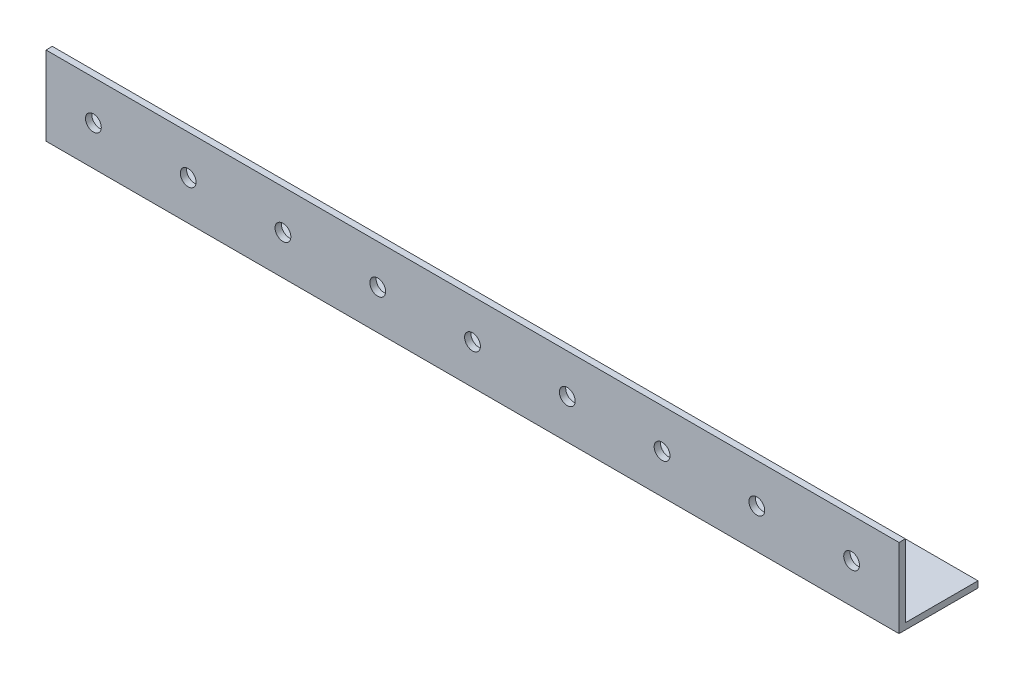
ISO-10303-21;
HEADER;
FILE_DESCRIPTION(('STEP AP214'),'2;1');
FILE_NAME('part.step','',(''),(''),'','','');
FILE_SCHEMA(('AUTOMOTIVE_DESIGN { 1 0 10303 214 1 1 1 1 }'));
ENDSEC;
DATA;
#1=APPLICATION_CONTEXT('core data for automotive mechanical design processes');
#2=APPLICATION_PROTOCOL_DEFINITION('international standard','automotive_design',2000,#1);
#3=PRODUCT_CONTEXT('',#1,'mechanical');
#4=PRODUCT('Part','Part','',(#3));
#5=PRODUCT_RELATED_PRODUCT_CATEGORY('part','',(#4));
#6=PRODUCT_DEFINITION_FORMATION('','',#4);
#7=PRODUCT_DEFINITION_CONTEXT('part definition',#1,'design');
#8=PRODUCT_DEFINITION('design','',#6,#7);
#9=PRODUCT_DEFINITION_SHAPE('','',#8);
#10=(LENGTH_UNIT() NAMED_UNIT(*) SI_UNIT(.MILLI.,.METRE.));
#11=(NAMED_UNIT(*) PLANE_ANGLE_UNIT() SI_UNIT($,.RADIAN.));
#12=(NAMED_UNIT(*) SI_UNIT($,.STERADIAN.) SOLID_ANGLE_UNIT());
#13=UNCERTAINTY_MEASURE_WITH_UNIT(LENGTH_MEASURE(1.E-05),#10,'distance_accuracy_value','');
#14=(GEOMETRIC_REPRESENTATION_CONTEXT(3) GLOBAL_UNCERTAINTY_ASSIGNED_CONTEXT((#13)) GLOBAL_UNIT_ASSIGNED_CONTEXT((#10,
#11,#12)) REPRESENTATION_CONTEXT('',''));
#15=CARTESIAN_POINT('',(0.,0.,0.));
#16=DIRECTION('',(0.,0.,1.));
#17=DIRECTION('',(1.,0.,0.));
#18=AXIS2_PLACEMENT_3D('',#15,#16,#17);
#19=CARTESIAN_POINT('',(539.999999999999,0.,0.));
#20=DIRECTION('',(0.,1.,0.));
#21=DIRECTION('',(0.,0.,1.));
#22=AXIS2_PLACEMENT_3D('',#19,#20,#21);
#23=PLANE('',#22);
#24=CARTESIAN_POINT('',(30.,0.,-25.));
#25=DIRECTION('',(0.,-1.,0.));
#26=DIRECTION('',(0.,0.,-1.));
#27=AXIS2_PLACEMENT_3D('',#24,#25,#26);
#28=CIRCLE('',#27,5.);
#29=CARTESIAN_POINT('',(30.,0.,-30.));
#30=VERTEX_POINT('',#29);
#31=EDGE_CURVE('E141',#30,#30,#28,.T.);
#32=ORIENTED_EDGE('',*,*,#31,.F.);
#33=EDGE_LOOP('',(#32));
#34=FACE_BOUND('',#33,.T.);
#35=CARTESIAN_POINT('',(90.,0.,-25.));
#36=DIRECTION('',(0.,-1.,0.));
#37=DIRECTION('',(0.,0.,-1.));
#38=AXIS2_PLACEMENT_3D('',#35,#36,#37);
#39=CIRCLE('',#38,5.);
#40=CARTESIAN_POINT('',(90.,0.,-30.));
#41=VERTEX_POINT('',#40);
#42=EDGE_CURVE('E257',#41,#41,#39,.T.);
#43=ORIENTED_EDGE('',*,*,#42,.F.);
#44=EDGE_LOOP('',(#43));
#45=FACE_BOUND('',#44,.T.);
#46=CARTESIAN_POINT('',(150.,0.,-25.));
#47=DIRECTION('',(0.,-1.,0.));
#48=DIRECTION('',(0.,0.,-1.));
#49=AXIS2_PLACEMENT_3D('',#46,#47,#48);
#50=CIRCLE('',#49,5.00000000000002);
#51=CARTESIAN_POINT('',(150.,0.,-30.));
#52=VERTEX_POINT('',#51);
#53=EDGE_CURVE('E261',#52,#52,#50,.T.);
#54=ORIENTED_EDGE('',*,*,#53,.F.);
#55=EDGE_LOOP('',(#54));
#56=FACE_BOUND('',#55,.T.);
#57=CARTESIAN_POINT('',(210.,0.,-25.));
#58=DIRECTION('',(0.,-1.,0.));
#59=DIRECTION('',(0.,0.,-1.));
#60=AXIS2_PLACEMENT_3D('',#57,#58,#59);
#61=CIRCLE('',#60,5.00000000000002);
#62=CARTESIAN_POINT('',(210.,0.,-30.));
#63=VERTEX_POINT('',#62);
#64=EDGE_CURVE('E265',#63,#63,#61,.T.);
#65=ORIENTED_EDGE('',*,*,#64,.F.);
#66=EDGE_LOOP('',(#65));
#67=FACE_BOUND('',#66,.T.);
#68=CARTESIAN_POINT('',(270.,0.,-25.));
#69=DIRECTION('',(0.,-1.,0.));
#70=DIRECTION('',(0.,0.,-1.));
#71=AXIS2_PLACEMENT_3D('',#68,#69,#70);
#72=CIRCLE('',#71,4.99999999999999);
#73=CARTESIAN_POINT('',(270.,0.,-30.));
#74=VERTEX_POINT('',#73);
#75=EDGE_CURVE('E269',#74,#74,#72,.T.);
#76=ORIENTED_EDGE('',*,*,#75,.F.);
#77=EDGE_LOOP('',(#76));
#78=FACE_BOUND('',#77,.T.);
#79=CARTESIAN_POINT('',(330.,0.,-25.));
#80=DIRECTION('',(0.,-1.,0.));
#81=DIRECTION('',(0.,0.,-1.));
#82=AXIS2_PLACEMENT_3D('',#79,#80,#81);
#83=CIRCLE('',#82,5.00000000000004);
#84=CARTESIAN_POINT('',(330.,0.,-30.));
#85=VERTEX_POINT('',#84);
#86=EDGE_CURVE('E273',#85,#85,#83,.T.);
#87=ORIENTED_EDGE('',*,*,#86,.F.);
#88=EDGE_LOOP('',(#87));
#89=FACE_BOUND('',#88,.T.);
#90=CARTESIAN_POINT('',(390.,0.,-25.));
#91=DIRECTION('',(0.,-1.,0.));
#92=DIRECTION('',(0.,0.,-1.));
#93=AXIS2_PLACEMENT_3D('',#90,#91,#92);
#94=CIRCLE('',#93,4.99999999999999);
#95=CARTESIAN_POINT('',(390.,0.,-30.));
#96=VERTEX_POINT('',#95);
#97=EDGE_CURVE('E277',#96,#96,#94,.T.);
#98=ORIENTED_EDGE('',*,*,#97,.F.);
#99=EDGE_LOOP('',(#98));
#100=FACE_BOUND('',#99,.T.);
#101=CARTESIAN_POINT('',(450.,0.,-25.));
#102=DIRECTION('',(0.,-1.,0.));
#103=DIRECTION('',(0.,0.,-1.));
#104=AXIS2_PLACEMENT_3D('',#101,#102,#103);
#105=CIRCLE('',#104,5.00000000000004);
#106=CARTESIAN_POINT('',(450.,0.,-30.));
#107=VERTEX_POINT('',#106);
#108=EDGE_CURVE('E281',#107,#107,#105,.T.);
#109=ORIENTED_EDGE('',*,*,#108,.F.);
#110=EDGE_LOOP('',(#109));
#111=FACE_BOUND('',#110,.T.);
#112=CARTESIAN_POINT('',(510.,0.,-25.));
#113=DIRECTION('',(0.,-1.,0.));
#114=DIRECTION('',(0.,0.,-1.));
#115=AXIS2_PLACEMENT_3D('',#112,#113,#114);
#116=CIRCLE('',#115,4.99999999999994);
#117=CARTESIAN_POINT('',(510.,0.,-29.9999999999999));
#118=VERTEX_POINT('',#117);
#119=EDGE_CURVE('E284',#118,#118,#116,.T.);
#120=ORIENTED_EDGE('',*,*,#119,.F.);
#121=EDGE_LOOP('',(#120));
#122=FACE_BOUND('',#121,.T.);
#123=DIRECTION('',(0.,0.,-1.));
#124=VECTOR('',#123,1.);
#125=CARTESIAN_POINT('',(0.,0.,0.));
#126=LINE('',#125,#124);
#127=CARTESIAN_POINT('',(0.,0.,0.));
#128=VERTEX_POINT('',#127);
#129=CARTESIAN_POINT('',(0.,0.,-50.));
#130=VERTEX_POINT('',#129);
#131=EDGE_CURVE('E119',#128,#130,#126,.T.);
#132=ORIENTED_EDGE('',*,*,#131,.T.);
#133=DIRECTION('',(-1.,0.,0.));
#134=VECTOR('',#133,1.);
#135=CARTESIAN_POINT('',(539.999999999999,0.,-50.));
#136=LINE('',#135,#134);
#137=CARTESIAN_POINT('',(539.999999999999,0.,-50.));
#138=VERTEX_POINT('',#137);
#139=EDGE_CURVE('E11',#138,#130,#136,.T.);
#140=ORIENTED_EDGE('',*,*,#139,.F.);
#141=DIRECTION('',(0.,0.,-1.));
#142=VECTOR('',#141,1.);
#143=CARTESIAN_POINT('',(539.999999999999,0.,0.));
#144=LINE('',#143,#142);
#145=CARTESIAN_POINT('',(539.999999999999,0.,0.));
#146=VERTEX_POINT('',#145);
#147=EDGE_CURVE('E84',#146,#138,#144,.T.);
#148=ORIENTED_EDGE('',*,*,#147,.F.);
#149=DIRECTION('',(-1.,0.,0.));
#150=VECTOR('',#149,1.);
#151=CARTESIAN_POINT('',(539.999999999999,0.,0.));
#152=LINE('',#151,#150);
#153=EDGE_CURVE('E115',#146,#128,#152,.T.);
#154=ORIENTED_EDGE('',*,*,#153,.T.);
#155=EDGE_LOOP('',(#132,#140,#148,#154));
#156=FACE_BOUND('',#155,.T.);
#157=ADVANCED_FACE('F36',(#34,#45,#56,#67,#78,#89,#100,#111,#122,#156),#23,.F.);
#158=CARTESIAN_POINT('',(539.999999999999,4.,-50.));
#159=DIRECTION('',(0.,0.,-1.));
#160=DIRECTION('',(-1.,0.,0.));
#161=AXIS2_PLACEMENT_3D('',#158,#159,#160);
#162=PLANE('',#161);
#163=DIRECTION('',(0.,-1.,0.));
#164=VECTOR('',#163,1.);
#165=CARTESIAN_POINT('',(0.,4.,-50.));
#166=LINE('',#165,#164);
#167=CARTESIAN_POINT('',(0.,4.,-50.));
#168=VERTEX_POINT('',#167);
#169=EDGE_CURVE('E122',#168,#130,#166,.T.);
#170=ORIENTED_EDGE('',*,*,#169,.F.);
#171=DIRECTION('',(-1.,0.,0.));
#172=VECTOR('',#171,1.);
#173=CARTESIAN_POINT('',(539.999999999999,4.,-50.));
#174=LINE('',#173,#172);
#175=CARTESIAN_POINT('',(539.999999999999,4.,-50.));
#176=VERTEX_POINT('',#175);
#177=EDGE_CURVE('E45',#176,#168,#174,.T.);
#178=ORIENTED_EDGE('',*,*,#177,.F.);
#179=DIRECTION('',(0.,-1.,0.));
#180=VECTOR('',#179,1.);
#181=CARTESIAN_POINT('',(539.999999999999,4.,-50.));
#182=LINE('',#181,#180);
#183=EDGE_CURVE('E221',#176,#138,#182,.T.);
#184=ORIENTED_EDGE('',*,*,#183,.T.);
#185=ORIENTED_EDGE('',*,*,#139,.T.);
#186=EDGE_LOOP('',(#170,#178,#184,#185));
#187=FACE_BOUND('',#186,.T.);
#188=ADVANCED_FACE('F245',(#187),#162,.T.);
#189=CARTESIAN_POINT('',(539.999999999999,4.,0.));
#190=DIRECTION('',(0.,1.,0.));
#191=DIRECTION('',(0.,0.,1.));
#192=AXIS2_PLACEMENT_3D('',#189,#190,#191);
#193=PLANE('',#192);
#194=CARTESIAN_POINT('',(30.,4.,-25.));
#195=DIRECTION('',(0.,1.,0.));
#196=DIRECTION('',(0.,0.,1.));
#197=AXIS2_PLACEMENT_3D('',#194,#195,#196);
#198=CIRCLE('',#197,5.);
#199=CARTESIAN_POINT('',(30.,4.,-20.));
#200=VERTEX_POINT('',#199);
#201=EDGE_CURVE('E39',#200,#200,#198,.T.);
#202=ORIENTED_EDGE('',*,*,#201,.F.);
#203=EDGE_LOOP('',(#202));
#204=FACE_BOUND('',#203,.T.);
#205=CARTESIAN_POINT('',(90.,4.,-25.));
#206=DIRECTION('',(0.,1.,0.));
#207=DIRECTION('',(0.,0.,1.));
#208=AXIS2_PLACEMENT_3D('',#205,#206,#207);
#209=CIRCLE('',#208,5.);
#210=CARTESIAN_POINT('',(90.,4.,-20.));
#211=VERTEX_POINT('',#210);
#212=EDGE_CURVE('E158',#211,#211,#209,.T.);
#213=ORIENTED_EDGE('',*,*,#212,.F.);
#214=EDGE_LOOP('',(#213));
#215=FACE_BOUND('',#214,.T.);
#216=CARTESIAN_POINT('',(150.,4.,-25.));
#217=DIRECTION('',(0.,1.,0.));
#218=DIRECTION('',(0.,0.,1.));
#219=AXIS2_PLACEMENT_3D('',#216,#217,#218);
#220=CIRCLE('',#219,5.00000000000002);
#221=CARTESIAN_POINT('',(150.,4.,-20.));
#222=VERTEX_POINT('',#221);
#223=EDGE_CURVE('E156',#222,#222,#220,.T.);
#224=ORIENTED_EDGE('',*,*,#223,.F.);
#225=EDGE_LOOP('',(#224));
#226=FACE_BOUND('',#225,.T.);
#227=CARTESIAN_POINT('',(210.,4.,-25.));
#228=DIRECTION('',(0.,1.,0.));
#229=DIRECTION('',(0.,0.,1.));
#230=AXIS2_PLACEMENT_3D('',#227,#228,#229);
#231=CIRCLE('',#230,5.00000000000002);
#232=CARTESIAN_POINT('',(210.,4.,-20.));
#233=VERTEX_POINT('',#232);
#234=EDGE_CURVE('E153',#233,#233,#231,.T.);
#235=ORIENTED_EDGE('',*,*,#234,.F.);
#236=EDGE_LOOP('',(#235));
#237=FACE_BOUND('',#236,.T.);
#238=CARTESIAN_POINT('',(270.,4.,-25.));
#239=DIRECTION('',(0.,1.,0.));
#240=DIRECTION('',(0.,0.,1.));
#241=AXIS2_PLACEMENT_3D('',#238,#239,#240);
#242=CIRCLE('',#241,4.99999999999999);
#243=CARTESIAN_POINT('',(270.,4.,-20.));
#244=VERTEX_POINT('',#243);
#245=EDGE_CURVE('E150',#244,#244,#242,.T.);
#246=ORIENTED_EDGE('',*,*,#245,.F.);
#247=EDGE_LOOP('',(#246));
#248=FACE_BOUND('',#247,.T.);
#249=CARTESIAN_POINT('',(330.,4.,-25.));
#250=DIRECTION('',(0.,1.,0.));
#251=DIRECTION('',(0.,0.,1.));
#252=AXIS2_PLACEMENT_3D('',#249,#250,#251);
#253=CIRCLE('',#252,5.00000000000004);
#254=CARTESIAN_POINT('',(330.,4.,-20.));
#255=VERTEX_POINT('',#254);
#256=EDGE_CURVE('E147',#255,#255,#253,.T.);
#257=ORIENTED_EDGE('',*,*,#256,.F.);
#258=EDGE_LOOP('',(#257));
#259=FACE_BOUND('',#258,.T.);
#260=CARTESIAN_POINT('',(390.,4.,-25.));
#261=DIRECTION('',(0.,1.,0.));
#262=DIRECTION('',(0.,0.,1.));
#263=AXIS2_PLACEMENT_3D('',#260,#261,#262);
#264=CIRCLE('',#263,4.99999999999999);
#265=CARTESIAN_POINT('',(390.,4.,-20.));
#266=VERTEX_POINT('',#265);
#267=EDGE_CURVE('E144',#266,#266,#264,.T.);
#268=ORIENTED_EDGE('',*,*,#267,.F.);
#269=EDGE_LOOP('',(#268));
#270=FACE_BOUND('',#269,.T.);
#271=CARTESIAN_POINT('',(450.,4.,-25.));
#272=DIRECTION('',(0.,1.,0.));
#273=DIRECTION('',(0.,0.,1.));
#274=AXIS2_PLACEMENT_3D('',#271,#272,#273);
#275=CIRCLE('',#274,5.00000000000004);
#276=CARTESIAN_POINT('',(450.,4.,-20.));
#277=VERTEX_POINT('',#276);
#278=EDGE_CURVE('E140',#277,#277,#275,.T.);
#279=ORIENTED_EDGE('',*,*,#278,.F.);
#280=EDGE_LOOP('',(#279));
#281=FACE_BOUND('',#280,.T.);
#282=CARTESIAN_POINT('',(510.,4.,-25.));
#283=DIRECTION('',(0.,1.,0.));
#284=DIRECTION('',(0.,0.,1.));
#285=AXIS2_PLACEMENT_3D('',#282,#283,#284);
#286=CIRCLE('',#285,4.99999999999994);
#287=CARTESIAN_POINT('',(510.,4.,-20.0000000000001));
#288=VERTEX_POINT('',#287);
#289=EDGE_CURVE('E137',#288,#288,#286,.T.);
#290=ORIENTED_EDGE('',*,*,#289,.F.);
#291=EDGE_LOOP('',(#290));
#292=FACE_BOUND('',#291,.T.);
#293=DIRECTION('',(0.,0.,-1.));
#294=VECTOR('',#293,1.);
#295=CARTESIAN_POINT('',(0.,4.,0.));
#296=LINE('',#295,#294);
#297=CARTESIAN_POINT('',(0.,4.,-4.));
#298=VERTEX_POINT('',#297);
#299=EDGE_CURVE('E126',#298,#168,#296,.T.);
#300=ORIENTED_EDGE('',*,*,#299,.F.);
#301=DIRECTION('',(-1.,0.,0.));
#302=VECTOR('',#301,1.);
#303=CARTESIAN_POINT('',(539.999999999999,4.,-4.));
#304=LINE('',#303,#302);
#305=CARTESIAN_POINT('',(539.999999999999,4.,-4.));
#306=VERTEX_POINT('',#305);
#307=EDGE_CURVE('E105',#306,#298,#304,.T.);
#308=ORIENTED_EDGE('',*,*,#307,.F.);
#309=DIRECTION('',(0.,0.,-1.));
#310=VECTOR('',#309,1.);
#311=CARTESIAN_POINT('',(539.999999999999,4.,0.));
#312=LINE('',#311,#310);
#313=EDGE_CURVE('E111',#306,#176,#312,.T.);
#314=ORIENTED_EDGE('',*,*,#313,.T.);
#315=ORIENTED_EDGE('',*,*,#177,.T.);
#316=EDGE_LOOP('',(#300,#308,#314,#315));
#317=FACE_BOUND('',#316,.T.);
#318=ADVANCED_FACE('F225',(#204,#215,#226,#237,#248,#259,#270,#281,#292,#317),#193,.T.);
#319=CARTESIAN_POINT('',(539.999999999999,0.,-4.));
#320=DIRECTION('',(0.,0.,-1.));
#321=DIRECTION('',(-1.,0.,0.));
#322=AXIS2_PLACEMENT_3D('',#319,#320,#321);
#323=PLANE('',#322);
#324=CARTESIAN_POINT('',(29.9999999999998,25.,-4.));
#325=DIRECTION('',(0.,0.,-1.));
#326=DIRECTION('',(-1.,0.,0.));
#327=AXIS2_PLACEMENT_3D('',#324,#325,#326);
#328=CIRCLE('',#327,4.99999999999998);
#329=CARTESIAN_POINT('',(24.9999999999998,25.,-4.));
#330=VERTEX_POINT('',#329);
#331=EDGE_CURVE('E123',#330,#330,#328,.T.);
#332=ORIENTED_EDGE('',*,*,#331,.F.);
#333=EDGE_LOOP('',(#332));
#334=FACE_BOUND('',#333,.T.);
#335=CARTESIAN_POINT('',(389.999999999999,25.,-4.));
#336=DIRECTION('',(0.,0.,-1.));
#337=DIRECTION('',(-1.,0.,0.));
#338=AXIS2_PLACEMENT_3D('',#335,#336,#337);
#339=CIRCLE('',#338,4.99999999999999);
#340=CARTESIAN_POINT('',(384.999999999999,25.,-4.));
#341=VERTEX_POINT('',#340);
#342=EDGE_CURVE('E215',#341,#341,#339,.T.);
#343=ORIENTED_EDGE('',*,*,#342,.F.);
#344=EDGE_LOOP('',(#343));
#345=FACE_BOUND('',#344,.T.);
#346=CARTESIAN_POINT('',(449.999999999999,25.,-4.));
#347=DIRECTION('',(0.,0.,-1.));
#348=DIRECTION('',(-1.,0.,0.));
#349=AXIS2_PLACEMENT_3D('',#346,#347,#348);
#350=CIRCLE('',#349,4.99999999999999);
#351=CARTESIAN_POINT('',(444.999999999999,25.,-4.));
#352=VERTEX_POINT('',#351);
#353=EDGE_CURVE('E212',#352,#352,#350,.T.);
#354=ORIENTED_EDGE('',*,*,#353,.F.);
#355=EDGE_LOOP('',(#354));
#356=FACE_BOUND('',#355,.T.);
#357=CARTESIAN_POINT('',(509.999999999999,25.,-4.));
#358=DIRECTION('',(0.,0.,-1.));
#359=DIRECTION('',(-1.,0.,0.));
#360=AXIS2_PLACEMENT_3D('',#357,#358,#359);
#361=CIRCLE('',#360,4.99999999999994);
#362=CARTESIAN_POINT('',(504.999999999999,25.,-4.));
#363=VERTEX_POINT('',#362);
#364=EDGE_CURVE('E209',#363,#363,#361,.T.);
#365=ORIENTED_EDGE('',*,*,#364,.F.);
#366=EDGE_LOOP('',(#365));
#367=FACE_BOUND('',#366,.T.);
#368=CARTESIAN_POINT('',(269.999999999999,25.,-4.));
#369=DIRECTION('',(0.,0.,-1.));
#370=DIRECTION('',(-1.,0.,0.));
#371=AXIS2_PLACEMENT_3D('',#368,#369,#370);
#372=CIRCLE('',#371,4.99999999999999);
#373=CARTESIAN_POINT('',(264.999999999999,25.,-4.));
#374=VERTEX_POINT('',#373);
#375=EDGE_CURVE('E206',#374,#374,#372,.T.);
#376=ORIENTED_EDGE('',*,*,#375,.F.);
#377=EDGE_LOOP('',(#376));
#378=FACE_BOUND('',#377,.T.);
#379=CARTESIAN_POINT('',(329.999999999999,25.,-4.));
#380=DIRECTION('',(0.,0.,-1.));
#381=DIRECTION('',(-1.,0.,0.));
#382=AXIS2_PLACEMENT_3D('',#379,#380,#381);
#383=CIRCLE('',#382,4.99999999999999);
#384=CARTESIAN_POINT('',(324.999999999999,25.,-4.));
#385=VERTEX_POINT('',#384);
#386=EDGE_CURVE('E203',#385,#385,#383,.T.);
#387=ORIENTED_EDGE('',*,*,#386,.F.);
#388=EDGE_LOOP('',(#387));
#389=FACE_BOUND('',#388,.T.);
#390=CARTESIAN_POINT('',(209.999999999999,25.,-4.));
#391=DIRECTION('',(0.,0.,-1.));
#392=DIRECTION('',(-1.,0.,0.));
#393=AXIS2_PLACEMENT_3D('',#390,#391,#392);
#394=CIRCLE('',#393,5.00000000000008);
#395=CARTESIAN_POINT('',(204.999999999999,25.,-4.));
#396=VERTEX_POINT('',#395);
#397=EDGE_CURVE('E200',#396,#396,#394,.T.);
#398=ORIENTED_EDGE('',*,*,#397,.F.);
#399=EDGE_LOOP('',(#398));
#400=FACE_BOUND('',#399,.T.);
#401=CARTESIAN_POINT('',(150.,25.,-4.));
#402=DIRECTION('',(0.,0.,-1.));
#403=DIRECTION('',(-1.,0.,0.));
#404=AXIS2_PLACEMENT_3D('',#401,#402,#403);
#405=CIRCLE('',#404,5.00000000000005);
#406=CARTESIAN_POINT('',(145.,25.,-4.));
#407=VERTEX_POINT('',#406);
#408=EDGE_CURVE('E197',#407,#407,#405,.T.);
#409=ORIENTED_EDGE('',*,*,#408,.F.);
#410=EDGE_LOOP('',(#409));
#411=FACE_BOUND('',#410,.T.);
#412=CARTESIAN_POINT('',(89.9999999999997,25.,-4.));
#413=DIRECTION('',(0.,0.,-1.));
#414=DIRECTION('',(-1.,0.,0.));
#415=AXIS2_PLACEMENT_3D('',#412,#413,#414);
#416=CIRCLE('',#415,4.99999999999999);
#417=CARTESIAN_POINT('',(84.9999999999997,25.,-4.));
#418=VERTEX_POINT('',#417);
#419=EDGE_CURVE('E194',#418,#418,#416,.T.);
#420=ORIENTED_EDGE('',*,*,#419,.F.);
#421=EDGE_LOOP('',(#420));
#422=FACE_BOUND('',#421,.T.);
#423=DIRECTION('',(0.,1.,0.));
#424=VECTOR('',#423,1.);
#425=CARTESIAN_POINT('',(0.,0.,-4.));
#426=LINE('',#425,#424);
#427=CARTESIAN_POINT('',(0.,50.,-4.));
#428=VERTEX_POINT('',#427);
#429=EDGE_CURVE('E100',#428,#298,#426,.F.);
#430=ORIENTED_EDGE('',*,*,#429,.F.);
#431=DIRECTION('',(-1.,0.,0.));
#432=VECTOR('',#431,1.);
#433=CARTESIAN_POINT('',(539.999999999999,50.,-4.));
#434=LINE('',#433,#432);
#435=CARTESIAN_POINT('',(539.999999999999,50.,-4.));
#436=VERTEX_POINT('',#435);
#437=EDGE_CURVE('E95',#436,#428,#434,.T.);
#438=ORIENTED_EDGE('',*,*,#437,.F.);
#439=DIRECTION('',(0.,1.,0.));
#440=VECTOR('',#439,1.);
#441=CARTESIAN_POINT('',(539.999999999999,0.,-4.));
#442=LINE('',#441,#440);
#443=EDGE_CURVE('E98',#436,#306,#442,.F.);
#444=ORIENTED_EDGE('',*,*,#443,.T.);
#445=ORIENTED_EDGE('',*,*,#307,.T.);
#446=EDGE_LOOP('',(#430,#438,#444,#445));
#447=FACE_BOUND('',#446,.T.);
#448=ADVANCED_FACE('F97',(#334,#345,#356,#367,#378,#389,#400,#411,#422,#447),#323,.T.);
#449=CARTESIAN_POINT('',(539.999999999999,50.,0.));
#450=DIRECTION('',(0.,1.,0.));
#451=DIRECTION('',(0.,0.,1.));
#452=AXIS2_PLACEMENT_3D('',#449,#450,#451);
#453=PLANE('',#452);
#454=DIRECTION('',(0.,0.,-1.));
#455=VECTOR('',#454,1.);
#456=CARTESIAN_POINT('',(0.,50.,0.));
#457=LINE('',#456,#455);
#458=CARTESIAN_POINT('',(0.,50.,0.));
#459=VERTEX_POINT('',#458);
#460=EDGE_CURVE('E130',#459,#428,#457,.T.);
#461=ORIENTED_EDGE('',*,*,#460,.F.);
#462=DIRECTION('',(-1.,0.,0.));
#463=VECTOR('',#462,1.);
#464=CARTESIAN_POINT('',(539.999999999999,50.,0.));
#465=LINE('',#464,#463);
#466=CARTESIAN_POINT('',(539.999999999999,50.,0.));
#467=VERTEX_POINT('',#466);
#468=EDGE_CURVE('E75',#467,#459,#465,.T.);
#469=ORIENTED_EDGE('',*,*,#468,.F.);
#470=DIRECTION('',(0.,0.,-1.));
#471=VECTOR('',#470,1.);
#472=CARTESIAN_POINT('',(539.999999999999,50.,0.));
#473=LINE('',#472,#471);
#474=EDGE_CURVE('E109',#467,#436,#473,.T.);
#475=ORIENTED_EDGE('',*,*,#474,.T.);
#476=ORIENTED_EDGE('',*,*,#437,.T.);
#477=EDGE_LOOP('',(#461,#469,#475,#476));
#478=FACE_BOUND('',#477,.T.);
#479=ADVANCED_FACE('F113',(#478),#453,.T.);
#480=CARTESIAN_POINT('',(539.999999999999,0.,0.));
#481=DIRECTION('',(0.,0.,-1.));
#482=DIRECTION('',(-1.,0.,0.));
#483=AXIS2_PLACEMENT_3D('',#480,#481,#482);
#484=PLANE('',#483);
#485=CARTESIAN_POINT('',(29.9999999999998,25.,0.));
#486=DIRECTION('',(0.,0.,1.));
#487=DIRECTION('',(1.,0.,0.));
#488=AXIS2_PLACEMENT_3D('',#485,#486,#487);
#489=CIRCLE('',#488,4.99999999999998);
#490=CARTESIAN_POINT('',(34.9999999999998,25.,0.));
#491=VERTEX_POINT('',#490);
#492=EDGE_CURVE('E185',#491,#491,#489,.T.);
#493=ORIENTED_EDGE('',*,*,#492,.F.);
#494=EDGE_LOOP('',(#493));
#495=FACE_BOUND('',#494,.T.);
#496=CARTESIAN_POINT('',(389.999999999999,25.,0.));
#497=DIRECTION('',(0.,0.,1.));
#498=DIRECTION('',(1.,0.,0.));
#499=AXIS2_PLACEMENT_3D('',#496,#497,#498);
#500=CIRCLE('',#499,4.99999999999999);
#501=CARTESIAN_POINT('',(394.999999999999,25.,0.));
#502=VERTEX_POINT('',#501);
#503=EDGE_CURVE('E176',#502,#502,#500,.T.);
#504=ORIENTED_EDGE('',*,*,#503,.F.);
#505=EDGE_LOOP('',(#504));
#506=FACE_BOUND('',#505,.T.);
#507=CARTESIAN_POINT('',(449.999999999999,25.,0.));
#508=DIRECTION('',(0.,0.,1.));
#509=DIRECTION('',(1.,0.,0.));
#510=AXIS2_PLACEMENT_3D('',#507,#508,#509);
#511=CIRCLE('',#510,4.99999999999999);
#512=CARTESIAN_POINT('',(454.999999999999,25.,0.));
#513=VERTEX_POINT('',#512);
#514=EDGE_CURVE('E172',#513,#513,#511,.T.);
#515=ORIENTED_EDGE('',*,*,#514,.F.);
#516=EDGE_LOOP('',(#515));
#517=FACE_BOUND('',#516,.T.);
#518=CARTESIAN_POINT('',(509.999999999999,25.,0.));
#519=DIRECTION('',(0.,0.,1.));
#520=DIRECTION('',(1.,0.,0.));
#521=AXIS2_PLACEMENT_3D('',#518,#519,#520);
#522=CIRCLE('',#521,4.99999999999994);
#523=CARTESIAN_POINT('',(514.999999999999,25.,0.));
#524=VERTEX_POINT('',#523);
#525=EDGE_CURVE('E167',#524,#524,#522,.T.);
#526=ORIENTED_EDGE('',*,*,#525,.F.);
#527=EDGE_LOOP('',(#526));
#528=FACE_BOUND('',#527,.T.);
#529=CARTESIAN_POINT('',(269.999999999999,25.,0.));
#530=DIRECTION('',(0.,0.,1.));
#531=DIRECTION('',(1.,0.,0.));
#532=AXIS2_PLACEMENT_3D('',#529,#530,#531);
#533=CIRCLE('',#532,4.99999999999999);
#534=CARTESIAN_POINT('',(274.999999999999,25.,0.));
#535=VERTEX_POINT('',#534);
#536=EDGE_CURVE('E163',#535,#535,#533,.T.);
#537=ORIENTED_EDGE('',*,*,#536,.F.);
#538=EDGE_LOOP('',(#537));
#539=FACE_BOUND('',#538,.T.);
#540=CARTESIAN_POINT('',(329.999999999999,25.,0.));
#541=DIRECTION('',(0.,0.,1.));
#542=DIRECTION('',(1.,0.,0.));
#543=AXIS2_PLACEMENT_3D('',#540,#541,#542);
#544=CIRCLE('',#543,4.99999999999999);
#545=CARTESIAN_POINT('',(334.999999999999,25.,0.));
#546=VERTEX_POINT('',#545);
#547=EDGE_CURVE('E179',#546,#546,#544,.T.);
#548=ORIENTED_EDGE('',*,*,#547,.F.);
#549=EDGE_LOOP('',(#548));
#550=FACE_BOUND('',#549,.T.);
#551=CARTESIAN_POINT('',(209.999999999999,25.,0.));
#552=DIRECTION('',(0.,0.,1.));
#553=DIRECTION('',(1.,0.,0.));
#554=AXIS2_PLACEMENT_3D('',#551,#552,#553);
#555=CIRCLE('',#554,5.00000000000008);
#556=CARTESIAN_POINT('',(215.,25.,0.));
#557=VERTEX_POINT('',#556);
#558=EDGE_CURVE('E189',#557,#557,#555,.T.);
#559=ORIENTED_EDGE('',*,*,#558,.F.);
#560=EDGE_LOOP('',(#559));
#561=FACE_BOUND('',#560,.T.);
#562=CARTESIAN_POINT('',(150.,25.,0.));
#563=DIRECTION('',(0.,0.,1.));
#564=DIRECTION('',(1.,0.,0.));
#565=AXIS2_PLACEMENT_3D('',#562,#563,#564);
#566=CIRCLE('',#565,5.00000000000005);
#567=CARTESIAN_POINT('',(155.,25.,0.));
#568=VERTEX_POINT('',#567);
#569=EDGE_CURVE('E186',#568,#568,#566,.T.);
#570=ORIENTED_EDGE('',*,*,#569,.F.);
#571=EDGE_LOOP('',(#570));
#572=FACE_BOUND('',#571,.T.);
#573=CARTESIAN_POINT('',(89.9999999999997,25.,0.));
#574=DIRECTION('',(0.,0.,1.));
#575=DIRECTION('',(1.,0.,0.));
#576=AXIS2_PLACEMENT_3D('',#573,#574,#575);
#577=CIRCLE('',#576,4.99999999999999);
#578=CARTESIAN_POINT('',(94.9999999999997,25.,0.));
#579=VERTEX_POINT('',#578);
#580=EDGE_CURVE('E182',#579,#579,#577,.T.);
#581=ORIENTED_EDGE('',*,*,#580,.F.);
#582=EDGE_LOOP('',(#581));
#583=FACE_BOUND('',#582,.T.);
#584=DIRECTION('',(0.,-1.,0.));
#585=VECTOR('',#584,1.);
#586=CARTESIAN_POINT('',(0.,0.,0.));
#587=LINE('',#586,#585);
#588=EDGE_CURVE('E78',#459,#128,#587,.T.);
#589=ORIENTED_EDGE('',*,*,#588,.T.);
#590=ORIENTED_EDGE('',*,*,#153,.F.);
#591=DIRECTION('',(0.,-1.,0.));
#592=VECTOR('',#591,1.);
#593=CARTESIAN_POINT('',(539.999999999999,0.,0.));
#594=LINE('',#593,#592);
#595=EDGE_CURVE('E54',#467,#146,#594,.T.);
#596=ORIENTED_EDGE('',*,*,#595,.F.);
#597=ORIENTED_EDGE('',*,*,#468,.T.);
#598=EDGE_LOOP('',(#589,#590,#596,#597));
#599=FACE_BOUND('',#598,.T.);
#600=ADVANCED_FACE('F231',(#495,#506,#517,#528,#539,#550,#561,#572,#583,#599),#484,.F.);
#601=CARTESIAN_POINT('',(539.999999999999,0.,0.));
#602=DIRECTION('',(-1.,0.,0.));
#603=DIRECTION('',(0.,0.,1.));
#604=AXIS2_PLACEMENT_3D('',#601,#602,#603);
#605=PLANE('',#604);
#606=ORIENTED_EDGE('',*,*,#147,.T.);
#607=ORIENTED_EDGE('',*,*,#183,.F.);
#608=ORIENTED_EDGE('',*,*,#313,.F.);
#609=ORIENTED_EDGE('',*,*,#443,.F.);
#610=ORIENTED_EDGE('',*,*,#474,.F.);
#611=ORIENTED_EDGE('',*,*,#595,.T.);
#612=EDGE_LOOP('',(#606,#607,#608,#609,#610,#611));
#613=FACE_BOUND('',#612,.T.);
#614=ADVANCED_FACE('F108',(#613),#605,.F.);
#615=CARTESIAN_POINT('',(0.,0.,0.));
#616=DIRECTION('',(-1.,0.,0.));
#617=DIRECTION('',(0.,0.,1.));
#618=AXIS2_PLACEMENT_3D('',#615,#616,#617);
#619=PLANE('',#618);
#620=ORIENTED_EDGE('',*,*,#131,.F.);
#621=ORIENTED_EDGE('',*,*,#588,.F.);
#622=ORIENTED_EDGE('',*,*,#460,.T.);
#623=ORIENTED_EDGE('',*,*,#429,.T.);
#624=ORIENTED_EDGE('',*,*,#299,.T.);
#625=ORIENTED_EDGE('',*,*,#169,.T.);
#626=EDGE_LOOP('',(#620,#621,#622,#623,#624,#625));
#627=FACE_BOUND('',#626,.T.);
#628=ADVANCED_FACE('F229',(#627),#619,.T.);
#629=CARTESIAN_POINT('',(89.9999999999997,25.,-50.));
#630=DIRECTION('',(0.,0.,1.));
#631=DIRECTION('',(1.,0.,0.));
#632=AXIS2_PLACEMENT_3D('',#629,#630,#631);
#633=CYLINDRICAL_SURFACE('',#632,4.99999999999999);
#634=ORIENTED_EDGE('',*,*,#419,.T.);
#635=EDGE_LOOP('',(#634));
#636=FACE_BOUND('',#635,.T.);
#637=ORIENTED_EDGE('',*,*,#580,.T.);
#638=EDGE_LOOP('',(#637));
#639=FACE_BOUND('',#638,.T.);
#640=ADVANCED_FACE('F321',(#636,#639),#633,.F.);
#641=CARTESIAN_POINT('',(150.,25.,-50.));
#642=DIRECTION('',(0.,0.,1.));
#643=DIRECTION('',(1.,0.,0.));
#644=AXIS2_PLACEMENT_3D('',#641,#642,#643);
#645=CYLINDRICAL_SURFACE('',#644,5.00000000000005);
#646=ORIENTED_EDGE('',*,*,#408,.T.);
#647=EDGE_LOOP('',(#646));
#648=FACE_BOUND('',#647,.T.);
#649=ORIENTED_EDGE('',*,*,#569,.T.);
#650=EDGE_LOOP('',(#649));
#651=FACE_BOUND('',#650,.T.);
#652=ADVANCED_FACE('F324',(#648,#651),#645,.F.);
#653=CARTESIAN_POINT('',(209.999999999999,25.,-50.));
#654=DIRECTION('',(0.,0.,1.));
#655=DIRECTION('',(1.,0.,0.));
#656=AXIS2_PLACEMENT_3D('',#653,#654,#655);
#657=CYLINDRICAL_SURFACE('',#656,5.00000000000008);
#658=ORIENTED_EDGE('',*,*,#397,.T.);
#659=EDGE_LOOP('',(#658));
#660=FACE_BOUND('',#659,.T.);
#661=ORIENTED_EDGE('',*,*,#558,.T.);
#662=EDGE_LOOP('',(#661));
#663=FACE_BOUND('',#662,.T.);
#664=ADVANCED_FACE('F328',(#660,#663),#657,.F.);
#665=CARTESIAN_POINT('',(329.999999999999,25.,-50.));
#666=DIRECTION('',(0.,0.,1.));
#667=DIRECTION('',(1.,0.,0.));
#668=AXIS2_PLACEMENT_3D('',#665,#666,#667);
#669=CYLINDRICAL_SURFACE('',#668,4.99999999999999);
#670=ORIENTED_EDGE('',*,*,#386,.T.);
#671=EDGE_LOOP('',(#670));
#672=FACE_BOUND('',#671,.T.);
#673=ORIENTED_EDGE('',*,*,#547,.T.);
#674=EDGE_LOOP('',(#673));
#675=FACE_BOUND('',#674,.T.);
#676=ADVANCED_FACE('F315',(#672,#675),#669,.F.);
#677=CARTESIAN_POINT('',(269.999999999999,25.,-50.));
#678=DIRECTION('',(0.,0.,1.));
#679=DIRECTION('',(1.,0.,0.));
#680=AXIS2_PLACEMENT_3D('',#677,#678,#679);
#681=CYLINDRICAL_SURFACE('',#680,4.99999999999999);
#682=ORIENTED_EDGE('',*,*,#375,.T.);
#683=EDGE_LOOP('',(#682));
#684=FACE_BOUND('',#683,.T.);
#685=ORIENTED_EDGE('',*,*,#536,.T.);
#686=EDGE_LOOP('',(#685));
#687=FACE_BOUND('',#686,.T.);
#688=ADVANCED_FACE('F312',(#684,#687),#681,.F.);
#689=CARTESIAN_POINT('',(509.999999999999,25.,-50.));
#690=DIRECTION('',(0.,0.,1.));
#691=DIRECTION('',(1.,0.,0.));
#692=AXIS2_PLACEMENT_3D('',#689,#690,#691);
#693=CYLINDRICAL_SURFACE('',#692,4.99999999999994);
#694=ORIENTED_EDGE('',*,*,#364,.T.);
#695=EDGE_LOOP('',(#694));
#696=FACE_BOUND('',#695,.T.);
#697=ORIENTED_EDGE('',*,*,#525,.T.);
#698=EDGE_LOOP('',(#697));
#699=FACE_BOUND('',#698,.T.);
#700=ADVANCED_FACE('F309',(#696,#699),#693,.F.);
#701=CARTESIAN_POINT('',(449.999999999999,25.,-50.));
#702=DIRECTION('',(0.,0.,1.));
#703=DIRECTION('',(1.,0.,0.));
#704=AXIS2_PLACEMENT_3D('',#701,#702,#703);
#705=CYLINDRICAL_SURFACE('',#704,4.99999999999999);
#706=ORIENTED_EDGE('',*,*,#353,.T.);
#707=EDGE_LOOP('',(#706));
#708=FACE_BOUND('',#707,.T.);
#709=ORIENTED_EDGE('',*,*,#514,.T.);
#710=EDGE_LOOP('',(#709));
#711=FACE_BOUND('',#710,.T.);
#712=ADVANCED_FACE('F304',(#708,#711),#705,.F.);
#713=CARTESIAN_POINT('',(389.999999999999,25.,-50.));
#714=DIRECTION('',(0.,0.,1.));
#715=DIRECTION('',(1.,0.,0.));
#716=AXIS2_PLACEMENT_3D('',#713,#714,#715);
#717=CYLINDRICAL_SURFACE('',#716,4.99999999999999);
#718=ORIENTED_EDGE('',*,*,#342,.T.);
#719=EDGE_LOOP('',(#718));
#720=FACE_BOUND('',#719,.T.);
#721=ORIENTED_EDGE('',*,*,#503,.T.);
#722=EDGE_LOOP('',(#721));
#723=FACE_BOUND('',#722,.T.);
#724=ADVANCED_FACE('F294',(#720,#723),#717,.F.);
#725=CARTESIAN_POINT('',(29.9999999999998,25.,-50.));
#726=DIRECTION('',(0.,0.,1.));
#727=DIRECTION('',(1.,0.,0.));
#728=AXIS2_PLACEMENT_3D('',#725,#726,#727);
#729=CYLINDRICAL_SURFACE('',#728,4.99999999999998);
#730=ORIENTED_EDGE('',*,*,#331,.T.);
#731=EDGE_LOOP('',(#730));
#732=FACE_BOUND('',#731,.T.);
#733=ORIENTED_EDGE('',*,*,#492,.T.);
#734=EDGE_LOOP('',(#733));
#735=FACE_BOUND('',#734,.T.);
#736=ADVANCED_FACE('F291',(#732,#735),#729,.F.);
#737=CARTESIAN_POINT('',(510.,50.,-25.));
#738=DIRECTION('',(0.,-1.,0.));
#739=DIRECTION('',(0.,0.,-1.));
#740=AXIS2_PLACEMENT_3D('',#737,#738,#739);
#741=CYLINDRICAL_SURFACE('',#740,4.99999999999994);
#742=ORIENTED_EDGE('',*,*,#289,.T.);
#743=EDGE_LOOP('',(#742));
#744=FACE_BOUND('',#743,.T.);
#745=ORIENTED_EDGE('',*,*,#119,.T.);
#746=EDGE_LOOP('',(#745));
#747=FACE_BOUND('',#746,.T.);
#748=ADVANCED_FACE('F293',(#744,#747),#741,.F.);
#749=CARTESIAN_POINT('',(450.,50.,-25.));
#750=DIRECTION('',(0.,-1.,0.));
#751=DIRECTION('',(0.,0.,-1.));
#752=AXIS2_PLACEMENT_3D('',#749,#750,#751);
#753=CYLINDRICAL_SURFACE('',#752,5.00000000000004);
#754=ORIENTED_EDGE('',*,*,#278,.T.);
#755=EDGE_LOOP('',(#754));
#756=FACE_BOUND('',#755,.T.);
#757=ORIENTED_EDGE('',*,*,#108,.T.);
#758=EDGE_LOOP('',(#757));
#759=FACE_BOUND('',#758,.T.);
#760=ADVANCED_FACE('F301',(#756,#759),#753,.F.);
#761=CARTESIAN_POINT('',(390.,50.,-25.));
#762=DIRECTION('',(0.,-1.,0.));
#763=DIRECTION('',(0.,0.,-1.));
#764=AXIS2_PLACEMENT_3D('',#761,#762,#763);
#765=CYLINDRICAL_SURFACE('',#764,4.99999999999999);
#766=ORIENTED_EDGE('',*,*,#267,.T.);
#767=EDGE_LOOP('',(#766));
#768=FACE_BOUND('',#767,.T.);
#769=ORIENTED_EDGE('',*,*,#97,.T.);
#770=EDGE_LOOP('',(#769));
#771=FACE_BOUND('',#770,.T.);
#772=ADVANCED_FACE('F408',(#768,#771),#765,.F.);
#773=CARTESIAN_POINT('',(330.,50.,-25.));
#774=DIRECTION('',(0.,-1.,0.));
#775=DIRECTION('',(0.,0.,-1.));
#776=AXIS2_PLACEMENT_3D('',#773,#774,#775);
#777=CYLINDRICAL_SURFACE('',#776,5.00000000000004);
#778=ORIENTED_EDGE('',*,*,#256,.T.);
#779=EDGE_LOOP('',(#778));
#780=FACE_BOUND('',#779,.T.);
#781=ORIENTED_EDGE('',*,*,#86,.T.);
#782=EDGE_LOOP('',(#781));
#783=FACE_BOUND('',#782,.T.);
#784=ADVANCED_FACE('F417',(#780,#783),#777,.F.);
#785=CARTESIAN_POINT('',(270.,50.,-25.));
#786=DIRECTION('',(0.,-1.,0.));
#787=DIRECTION('',(0.,0.,-1.));
#788=AXIS2_PLACEMENT_3D('',#785,#786,#787);
#789=CYLINDRICAL_SURFACE('',#788,4.99999999999999);
#790=ORIENTED_EDGE('',*,*,#245,.T.);
#791=EDGE_LOOP('',(#790));
#792=FACE_BOUND('',#791,.T.);
#793=ORIENTED_EDGE('',*,*,#75,.T.);
#794=EDGE_LOOP('',(#793));
#795=FACE_BOUND('',#794,.T.);
#796=ADVANCED_FACE('F427',(#792,#795),#789,.F.);
#797=CARTESIAN_POINT('',(210.,50.,-25.));
#798=DIRECTION('',(0.,-1.,0.));
#799=DIRECTION('',(0.,0.,-1.));
#800=AXIS2_PLACEMENT_3D('',#797,#798,#799);
#801=CYLINDRICAL_SURFACE('',#800,5.00000000000002);
#802=ORIENTED_EDGE('',*,*,#234,.T.);
#803=EDGE_LOOP('',(#802));
#804=FACE_BOUND('',#803,.T.);
#805=ORIENTED_EDGE('',*,*,#64,.T.);
#806=EDGE_LOOP('',(#805));
#807=FACE_BOUND('',#806,.T.);
#808=ADVANCED_FACE('F437',(#804,#807),#801,.F.);
#809=CARTESIAN_POINT('',(150.,50.,-25.));
#810=DIRECTION('',(0.,-1.,0.));
#811=DIRECTION('',(0.,0.,-1.));
#812=AXIS2_PLACEMENT_3D('',#809,#810,#811);
#813=CYLINDRICAL_SURFACE('',#812,5.00000000000002);
#814=ORIENTED_EDGE('',*,*,#223,.T.);
#815=EDGE_LOOP('',(#814));
#816=FACE_BOUND('',#815,.T.);
#817=ORIENTED_EDGE('',*,*,#53,.T.);
#818=EDGE_LOOP('',(#817));
#819=FACE_BOUND('',#818,.T.);
#820=ADVANCED_FACE('F447',(#816,#819),#813,.F.);
#821=CARTESIAN_POINT('',(90.,50.,-25.));
#822=DIRECTION('',(0.,-1.,0.));
#823=DIRECTION('',(0.,0.,-1.));
#824=AXIS2_PLACEMENT_3D('',#821,#822,#823);
#825=CYLINDRICAL_SURFACE('',#824,5.);
#826=ORIENTED_EDGE('',*,*,#212,.T.);
#827=EDGE_LOOP('',(#826));
#828=FACE_BOUND('',#827,.T.);
#829=ORIENTED_EDGE('',*,*,#42,.T.);
#830=EDGE_LOOP('',(#829));
#831=FACE_BOUND('',#830,.T.);
#832=ADVANCED_FACE('F457',(#828,#831),#825,.F.);
#833=CARTESIAN_POINT('',(30.,50.,-25.));
#834=DIRECTION('',(0.,-1.,0.));
#835=DIRECTION('',(0.,0.,-1.));
#836=AXIS2_PLACEMENT_3D('',#833,#834,#835);
#837=CYLINDRICAL_SURFACE('',#836,5.);
#838=ORIENTED_EDGE('',*,*,#201,.T.);
#839=EDGE_LOOP('',(#838));
#840=FACE_BOUND('',#839,.T.);
#841=ORIENTED_EDGE('',*,*,#31,.T.);
#842=EDGE_LOOP('',(#841));
#843=FACE_BOUND('',#842,.T.);
#844=ADVANCED_FACE('F467',(#840,#843),#837,.F.);
#845=CLOSED_SHELL('',(#157,#188,#318,#448,#479,#600,#614,#628,#640,#652,#664,#676,#688,#700,
#712,#724,#736,#748,#760,#772,#784,#796,#808,#820,#832,#844));
#846=MANIFOLD_SOLID_BREP('B2',#845);
#847=ADVANCED_BREP_SHAPE_REPRESENTATION('',(#18,#846),#14);
#848=SHAPE_DEFINITION_REPRESENTATION(#9,#847);
ENDSEC;
END-ISO-10303-21;
